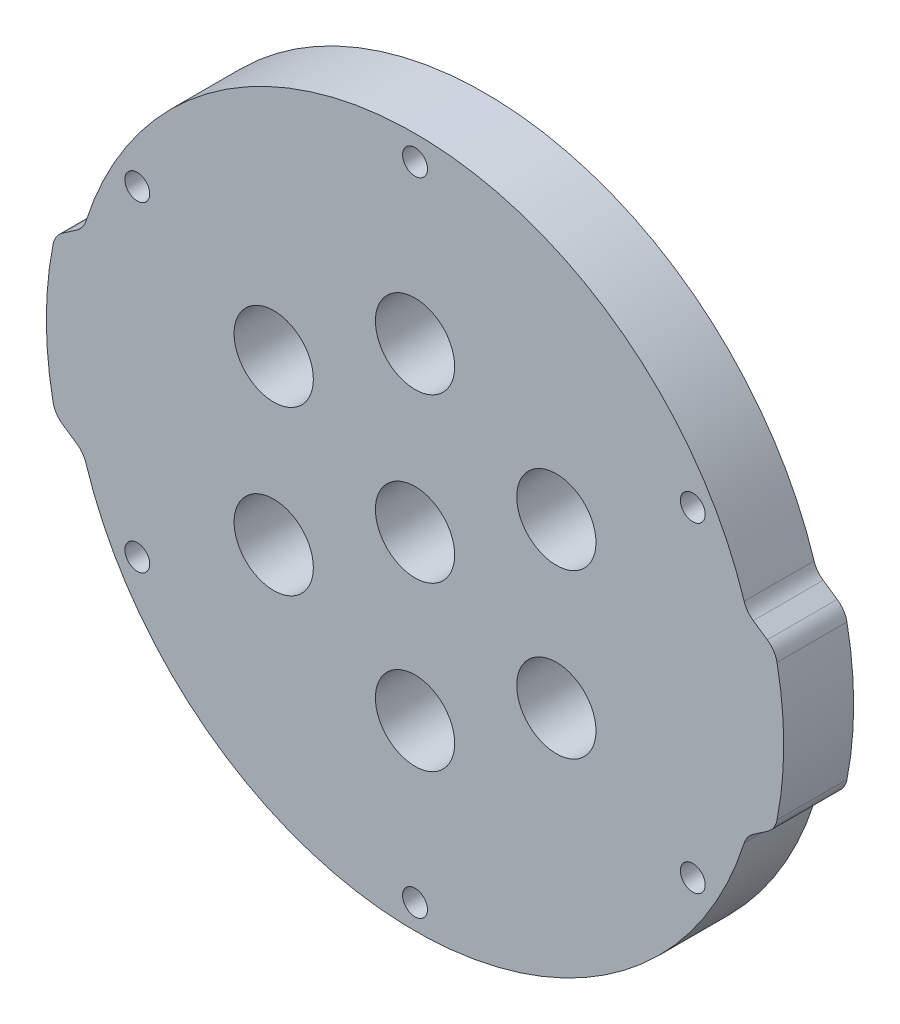
ISO-10303-21;
HEADER;
FILE_DESCRIPTION(('STEP AP214'),'2;1');
FILE_NAME('part.step','',(''),(''),'','','');
FILE_SCHEMA(('AUTOMOTIVE_DESIGN { 1 0 10303 214 1 1 1 1 }'));
ENDSEC;
DATA;
#1=APPLICATION_CONTEXT('core data for automotive mechanical design processes');
#2=APPLICATION_PROTOCOL_DEFINITION('international standard','automotive_design',2000,#1);
#3=PRODUCT_CONTEXT('',#1,'mechanical');
#4=PRODUCT('Part','Part','',(#3));
#5=PRODUCT_RELATED_PRODUCT_CATEGORY('part','',(#4));
#6=PRODUCT_DEFINITION_FORMATION('','',#4);
#7=PRODUCT_DEFINITION_CONTEXT('part definition',#1,'design');
#8=PRODUCT_DEFINITION('design','',#6,#7);
#9=PRODUCT_DEFINITION_SHAPE('','',#8);
#10=(LENGTH_UNIT() NAMED_UNIT(*) SI_UNIT(.MILLI.,.METRE.));
#11=(NAMED_UNIT(*) PLANE_ANGLE_UNIT() SI_UNIT($,.RADIAN.));
#12=(NAMED_UNIT(*) SI_UNIT($,.STERADIAN.) SOLID_ANGLE_UNIT());
#13=UNCERTAINTY_MEASURE_WITH_UNIT(LENGTH_MEASURE(1.E-05),#10,'distance_accuracy_value','');
#14=(GEOMETRIC_REPRESENTATION_CONTEXT(3) GLOBAL_UNCERTAINTY_ASSIGNED_CONTEXT((#13)) GLOBAL_UNIT_ASSIGNED_CONTEXT((#10,
#11,#12)) REPRESENTATION_CONTEXT('',''));
#15=CARTESIAN_POINT('',(0.,0.,0.));
#16=DIRECTION('',(0.,0.,1.));
#17=DIRECTION('',(1.,0.,0.));
#18=AXIS2_PLACEMENT_3D('',#15,#16,#17);
#19=CARTESIAN_POINT('',(2.45,0.,9.));
#20=DIRECTION('',(0.,0.,-1.));
#21=DIRECTION('',(-1.,0.,0.));
#22=AXIS2_PLACEMENT_3D('',#19,#20,#21);
#23=PLANE('',#22);
#24=CARTESIAN_POINT('',(-18.1865334794732,10.5,9.));
#25=DIRECTION('',(0.,0.,1.));
#26=DIRECTION('',(1.,0.,0.));
#27=AXIS2_PLACEMENT_3D('',#24,#25,#26);
#28=CIRCLE('',#27,5.1);
#29=CARTESIAN_POINT('',(-13.0865334794732,10.5,9.));
#30=VERTEX_POINT('',#29);
#31=EDGE_CURVE('E572',#30,#30,#28,.T.);
#32=ORIENTED_EDGE('',*,*,#31,.F.);
#33=EDGE_LOOP('',(#32));
#34=FACE_BOUND('',#33,.T.);
#35=CARTESIAN_POINT('',(-18.1865334794732,-10.5,9.));
#36=DIRECTION('',(0.,0.,1.));
#37=DIRECTION('',(1.,0.,0.));
#38=AXIS2_PLACEMENT_3D('',#35,#36,#37);
#39=CIRCLE('',#38,5.1);
#40=CARTESIAN_POINT('',(-13.0865334794732,-10.5,9.));
#41=VERTEX_POINT('',#40);
#42=EDGE_CURVE('E566',#41,#41,#39,.T.);
#43=ORIENTED_EDGE('',*,*,#42,.F.);
#44=EDGE_LOOP('',(#43));
#45=FACE_BOUND('',#44,.T.);
#46=CARTESIAN_POINT('',(0.,-21.,9.));
#47=DIRECTION('',(0.,0.,1.));
#48=DIRECTION('',(1.,0.,0.));
#49=AXIS2_PLACEMENT_3D('',#46,#47,#48);
#50=CIRCLE('',#49,5.1);
#51=CARTESIAN_POINT('',(5.1,-21.,9.));
#52=VERTEX_POINT('',#51);
#53=EDGE_CURVE('E560',#52,#52,#50,.T.);
#54=ORIENTED_EDGE('',*,*,#53,.F.);
#55=EDGE_LOOP('',(#54));
#56=FACE_BOUND('',#55,.T.);
#57=CARTESIAN_POINT('',(18.1865334794732,-10.5,9.));
#58=DIRECTION('',(0.,0.,1.));
#59=DIRECTION('',(1.,0.,0.));
#60=AXIS2_PLACEMENT_3D('',#57,#58,#59);
#61=CIRCLE('',#60,5.1);
#62=CARTESIAN_POINT('',(23.2865334794732,-10.5,9.));
#63=VERTEX_POINT('',#62);
#64=EDGE_CURVE('E554',#63,#63,#61,.T.);
#65=ORIENTED_EDGE('',*,*,#64,.F.);
#66=EDGE_LOOP('',(#65));
#67=FACE_BOUND('',#66,.T.);
#68=CARTESIAN_POINT('',(18.1865334794732,10.5,9.));
#69=DIRECTION('',(0.,0.,1.));
#70=DIRECTION('',(1.,0.,0.));
#71=AXIS2_PLACEMENT_3D('',#68,#69,#70);
#72=CIRCLE('',#71,5.09999999999999);
#73=CARTESIAN_POINT('',(23.2865334794732,10.5,9.));
#74=VERTEX_POINT('',#73);
#75=EDGE_CURVE('E548',#74,#74,#72,.T.);
#76=ORIENTED_EDGE('',*,*,#75,.F.);
#77=EDGE_LOOP('',(#76));
#78=FACE_BOUND('',#77,.T.);
#79=CARTESIAN_POINT('',(0.,0.,9.));
#80=DIRECTION('',(0.,0.,1.));
#81=DIRECTION('',(1.,0.,0.));
#82=AXIS2_PLACEMENT_3D('',#79,#80,#81);
#83=CIRCLE('',#82,5.1);
#84=CARTESIAN_POINT('',(5.1,0.,9.));
#85=VERTEX_POINT('',#84);
#86=EDGE_CURVE('E542',#85,#85,#83,.T.);
#87=ORIENTED_EDGE('',*,*,#86,.F.);
#88=EDGE_LOOP('',(#87));
#89=FACE_BOUND('',#88,.T.);
#90=CARTESIAN_POINT('',(0.,21.,9.));
#91=DIRECTION('',(0.,0.,1.));
#92=DIRECTION('',(1.,0.,0.));
#93=AXIS2_PLACEMENT_3D('',#90,#91,#92);
#94=CIRCLE('',#93,5.1);
#95=CARTESIAN_POINT('',(5.1,21.,9.));
#96=VERTEX_POINT('',#95);
#97=EDGE_CURVE('E536',#96,#96,#94,.T.);
#98=ORIENTED_EDGE('',*,*,#97,.F.);
#99=EDGE_LOOP('',(#98));
#100=FACE_BOUND('',#99,.T.);
#101=CARTESIAN_POINT('',(5.11138805749817E-12,-41.2750000000005,9.));
#102=DIRECTION('',(0.,0.,1.));
#103=DIRECTION('',(1.,0.,0.));
#104=AXIS2_PLACEMENT_3D('',#101,#102,#103);
#105=CIRCLE('',#104,1.6);
#106=CARTESIAN_POINT('',(1.60000000000511,-41.2750000000005,9.));
#107=VERTEX_POINT('',#106);
#108=EDGE_CURVE('E521',#107,#107,#105,.T.);
#109=ORIENTED_EDGE('',*,*,#108,.F.);
#110=EDGE_LOOP('',(#109));
#111=FACE_BOUND('',#110,.T.);
#112=CARTESIAN_POINT('',(35.7451985412042,20.6375000000021,9.));
#113=DIRECTION('',(0.,0.,1.));
#114=DIRECTION('',(1.,0.,0.));
#115=AXIS2_PLACEMENT_3D('',#112,#113,#114);
#116=CIRCLE('',#115,1.59999999999999);
#117=CARTESIAN_POINT('',(37.3451985412042,20.6375000000021,9.));
#118=VERTEX_POINT('',#117);
#119=EDGE_CURVE('E496',#118,#118,#116,.T.);
#120=ORIENTED_EDGE('',*,*,#119,.F.);
#121=EDGE_LOOP('',(#120));
#122=FACE_BOUND('',#121,.T.);
#123=CARTESIAN_POINT('',(0.,41.275,9.));
#124=DIRECTION('',(0.,0.,1.));
#125=DIRECTION('',(1.,0.,0.));
#126=AXIS2_PLACEMENT_3D('',#123,#124,#125);
#127=CIRCLE('',#126,1.6);
#128=CARTESIAN_POINT('',(1.6,41.275,9.));
#129=VERTEX_POINT('',#128);
#130=EDGE_CURVE('E174',#129,#129,#127,.T.);
#131=ORIENTED_EDGE('',*,*,#130,.F.);
#132=EDGE_LOOP('',(#131));
#133=FACE_BOUND('',#132,.T.);
#134=DIRECTION('',(0.826366164777737,0.563133165166583,0.));
#135=VECTOR('',#134,1.);
#136=CARTESIAN_POINT('',(46.3248219369606,-10.,9.));
#137=LINE('',#136,#135);
#138=CARTESIAN_POINT('',(43.5274449449631,-11.9062926663889,9.));
#139=VERTEX_POINT('',#138);
#140=CARTESIAN_POINT('',(45.3315955176947,-10.6768412854351,9.));
#141=VERTEX_POINT('',#140);
#142=EDGE_CURVE('E183',#139,#141,#137,.T.);
#143=ORIENTED_EDGE('',*,*,#142,.T.);
#144=CARTESIAN_POINT('',(43.642196022195,-8.19774279110192,9.));
#145=DIRECTION('',(0.,0.,-1.));
#146=DIRECTION('',(-1.,0.,0.));
#147=AXIS2_PLACEMENT_3D('',#144,#145,#146);
#148=CIRCLE('',#147,3.);
#149=CARTESIAN_POINT('',(46.5844957380661,-8.7832958476092,9.));
#150=VERTEX_POINT('',#149);
#151=EDGE_CURVE('E215',#141,#150,#148,.F.);
#152=ORIENTED_EDGE('',*,*,#151,.T.);
#153=CARTESIAN_POINT('',(2.45,0.,9.));
#154=DIRECTION('',(0.,0.,1.));
#155=DIRECTION('',(-1.,0.,0.));
#156=AXIS2_PLACEMENT_3D('',#153,#154,#155);
#157=CIRCLE('',#156,45.);
#158=CARTESIAN_POINT('',(46.5844957380661,8.7832958476092,9.));
#159=VERTEX_POINT('',#158);
#160=EDGE_CURVE('E166',#150,#159,#157,.T.);
#161=ORIENTED_EDGE('',*,*,#160,.T.);
#162=CARTESIAN_POINT('',(43.642196022195,8.19774279110192,9.));
#163=DIRECTION('',(0.,0.,-1.));
#164=DIRECTION('',(-1.,0.,0.));
#165=AXIS2_PLACEMENT_3D('',#162,#163,#164);
#166=CIRCLE('',#165,3.);
#167=CARTESIAN_POINT('',(45.3315955176947,10.6768412854351,9.));
#168=VERTEX_POINT('',#167);
#169=EDGE_CURVE('E213',#159,#168,#166,.F.);
#170=ORIENTED_EDGE('',*,*,#169,.T.);
#171=DIRECTION('',(-0.826366164777736,0.563133165166585,0.));
#172=VECTOR('',#171,1.);
#173=CARTESIAN_POINT('',(46.3248219369606,10.,9.));
#174=LINE('',#173,#172);
#175=CARTESIAN_POINT('',(43.5274449449631,11.9062926663889,9.));
#176=VERTEX_POINT('',#175);
#177=EDGE_CURVE('E283',#168,#176,#174,.T.);
#178=ORIENTED_EDGE('',*,*,#177,.T.);
#179=CARTESIAN_POINT('',(45.2168444404629,14.3853911607221,9.));
#180=DIRECTION('',(0.,0.,-1.));
#181=DIRECTION('',(-1.,0.,0.));
#182=AXIS2_PLACEMENT_3D('',#179,#180,#181);
#183=CIRCLE('',#182,3.);
#184=CARTESIAN_POINT('',(42.3580344653019,13.4758827627839,9.));
#185=VERTEX_POINT('',#184);
#186=EDGE_CURVE('E248',#176,#185,#183,.T.);
#187=ORIENTED_EDGE('',*,*,#186,.T.);
#188=CARTESIAN_POINT('',(0.,0.,9.));
#189=DIRECTION('',(0.,0.,1.));
#190=DIRECTION('',(1.,0.,0.));
#191=AXIS2_PLACEMENT_3D('',#188,#189,#190);
#192=CIRCLE('',#191,44.45);
#193=CARTESIAN_POINT('',(-42.3580344653019,13.4758827627839,9.));
#194=VERTEX_POINT('',#193);
#195=EDGE_CURVE('E274',#185,#194,#192,.T.);
#196=ORIENTED_EDGE('',*,*,#195,.T.);
#197=CARTESIAN_POINT('',(-45.2168444404629,14.3853911607221,9.));
#198=DIRECTION('',(0.,0.,-1.));
#199=DIRECTION('',(-1.,0.,0.));
#200=AXIS2_PLACEMENT_3D('',#197,#198,#199);
#201=CIRCLE('',#200,3.);
#202=CARTESIAN_POINT('',(-43.5274449449631,11.9062926663889,9.));
#203=VERTEX_POINT('',#202);
#204=EDGE_CURVE('E11',#194,#203,#201,.T.);
#205=ORIENTED_EDGE('',*,*,#204,.T.);
#206=DIRECTION('',(-0.826366164777736,-0.563133165166585,0.));
#207=VECTOR('',#206,1.);
#208=CARTESIAN_POINT('',(-46.3248219369606,10.,9.));
#209=LINE('',#208,#207);
#210=CARTESIAN_POINT('',(-45.3315955176947,10.6768412854351,9.));
#211=VERTEX_POINT('',#210);
#212=EDGE_CURVE('E272',#203,#211,#209,.T.);
#213=ORIENTED_EDGE('',*,*,#212,.T.);
#214=CARTESIAN_POINT('',(-43.642196022195,8.19774279110192,9.));
#215=DIRECTION('',(0.,0.,-1.));
#216=DIRECTION('',(-1.,0.,0.));
#217=AXIS2_PLACEMENT_3D('',#214,#215,#216);
#218=CIRCLE('',#217,3.);
#219=CARTESIAN_POINT('',(-46.5844957380661,8.7832958476092,9.));
#220=VERTEX_POINT('',#219);
#221=EDGE_CURVE('E209',#211,#220,#218,.F.);
#222=ORIENTED_EDGE('',*,*,#221,.T.);
#223=CARTESIAN_POINT('',(-2.45,0.,9.));
#224=DIRECTION('',(0.,0.,1.));
#225=DIRECTION('',(1.,0.,0.));
#226=AXIS2_PLACEMENT_3D('',#223,#224,#225);
#227=CIRCLE('',#226,45.);
#228=CARTESIAN_POINT('',(-46.5844957380661,-8.7832958476092,9.));
#229=VERTEX_POINT('',#228);
#230=EDGE_CURVE('E278',#220,#229,#227,.T.);
#231=ORIENTED_EDGE('',*,*,#230,.T.);
#232=CARTESIAN_POINT('',(-43.642196022195,-8.19774279110192,9.));
#233=DIRECTION('',(0.,0.,-1.));
#234=DIRECTION('',(-1.,0.,0.));
#235=AXIS2_PLACEMENT_3D('',#232,#233,#234);
#236=CIRCLE('',#235,3.);
#237=CARTESIAN_POINT('',(-45.3315955176947,-10.6768412854351,9.));
#238=VERTEX_POINT('',#237);
#239=EDGE_CURVE('E211',#229,#238,#236,.F.);
#240=ORIENTED_EDGE('',*,*,#239,.T.);
#241=DIRECTION('',(0.826366164777736,-0.563133165166585,0.));
#242=VECTOR('',#241,1.);
#243=CARTESIAN_POINT('',(-46.3248219369606,-10.,9.));
#244=LINE('',#243,#242);
#245=CARTESIAN_POINT('',(-43.5274449449631,-11.9062926663889,9.));
#246=VERTEX_POINT('',#245);
#247=EDGE_CURVE('E281',#238,#246,#244,.T.);
#248=ORIENTED_EDGE('',*,*,#247,.T.);
#249=CARTESIAN_POINT('',(-45.2168444404629,-14.3853911607221,9.));
#250=DIRECTION('',(0.,0.,-1.));
#251=DIRECTION('',(-1.,0.,0.));
#252=AXIS2_PLACEMENT_3D('',#249,#250,#251);
#253=CIRCLE('',#252,3.);
#254=CARTESIAN_POINT('',(-42.3580344653019,-13.475882762784,9.));
#255=VERTEX_POINT('',#254);
#256=EDGE_CURVE('E54',#246,#255,#253,.T.);
#257=ORIENTED_EDGE('',*,*,#256,.T.);
#258=CARTESIAN_POINT('',(0.,0.,9.));
#259=DIRECTION('',(0.,0.,1.));
#260=DIRECTION('',(1.,0.,0.));
#261=AXIS2_PLACEMENT_3D('',#258,#259,#260);
#262=CIRCLE('',#261,44.45);
#263=CARTESIAN_POINT('',(42.3580344653019,-13.4758827627839,9.));
#264=VERTEX_POINT('',#263);
#265=EDGE_CURVE('E287',#255,#264,#262,.T.);
#266=ORIENTED_EDGE('',*,*,#265,.T.);
#267=CARTESIAN_POINT('',(45.2168444404629,-14.3853911607221,9.));
#268=DIRECTION('',(0.,0.,-1.));
#269=DIRECTION('',(-1.,0.,0.));
#270=AXIS2_PLACEMENT_3D('',#267,#268,#269);
#271=CIRCLE('',#270,3.);
#272=EDGE_CURVE('E252',#264,#139,#271,.T.);
#273=ORIENTED_EDGE('',*,*,#272,.T.);
#274=EDGE_LOOP('',(#143,#152,#161,#170,#178,#187,#196,#205,#213,#222,#231,#240,#248,#257,#266,#273));
#275=FACE_BOUND('',#274,.T.);
#276=CARTESIAN_POINT('',(-35.7451985411991,-20.6375000000026,9.));
#277=DIRECTION('',(0.,0.,1.));
#278=DIRECTION('',(1.,0.,0.));
#279=AXIS2_PLACEMENT_3D('',#276,#277,#278);
#280=CIRCLE('',#279,1.6);
#281=CARTESIAN_POINT('',(-34.1451985411991,-20.6375000000026,9.));
#282=VERTEX_POINT('',#281);
#283=EDGE_CURVE('E492',#282,#282,#280,.T.);
#284=ORIENTED_EDGE('',*,*,#283,.F.);
#285=EDGE_LOOP('',(#284));
#286=FACE_BOUND('',#285,.T.);
#287=CARTESIAN_POINT('',(35.7451985412068,-20.6374999999982,9.));
#288=DIRECTION('',(0.,0.,1.));
#289=DIRECTION('',(1.,0.,0.));
#290=AXIS2_PLACEMENT_3D('',#287,#288,#289);
#291=CIRCLE('',#290,1.6);
#292=CARTESIAN_POINT('',(37.3451985412068,-20.6374999999982,9.));
#293=VERTEX_POINT('',#292);
#294=EDGE_CURVE('E516',#293,#293,#291,.T.);
#295=ORIENTED_EDGE('',*,*,#294,.F.);
#296=EDGE_LOOP('',(#295));
#297=FACE_BOUND('',#296,.T.);
#298=CARTESIAN_POINT('',(-35.7451985412017,20.6374999999976,9.));
#299=DIRECTION('',(0.,0.,1.));
#300=DIRECTION('',(1.,0.,0.));
#301=AXIS2_PLACEMENT_3D('',#298,#299,#300);
#302=CIRCLE('',#301,1.59999999999999);
#303=CARTESIAN_POINT('',(-34.1451985412017,20.6374999999976,9.));
#304=VERTEX_POINT('',#303);
#305=EDGE_CURVE('E527',#304,#304,#302,.T.);
#306=ORIENTED_EDGE('',*,*,#305,.F.);
#307=EDGE_LOOP('',(#306));
#308=FACE_BOUND('',#307,.T.);
#309=ADVANCED_FACE('F32',(#34,#45,#56,#67,#78,#89,#100,#111,#122,#133,#275,#286,#297,#308),#23,.F.);
#310=CARTESIAN_POINT('',(2.45,0.,0.));
#311=DIRECTION('',(0.,0.,-1.));
#312=DIRECTION('',(-1.,0.,0.));
#313=AXIS2_PLACEMENT_3D('',#310,#311,#312);
#314=PLANE('',#313);
#315=CARTESIAN_POINT('',(-18.1865334794732,10.5,0.));
#316=DIRECTION('',(0.,0.,1.));
#317=DIRECTION('',(1.,0.,0.));
#318=AXIS2_PLACEMENT_3D('',#315,#316,#317);
#319=CIRCLE('',#318,5.1);
#320=CARTESIAN_POINT('',(-13.0865334794732,10.5,0.));
#321=VERTEX_POINT('',#320);
#322=EDGE_CURVE('E569',#321,#321,#319,.T.);
#323=ORIENTED_EDGE('',*,*,#322,.T.);
#324=EDGE_LOOP('',(#323));
#325=FACE_BOUND('',#324,.T.);
#326=CARTESIAN_POINT('',(-18.1865334794732,-10.5,0.));
#327=DIRECTION('',(0.,0.,1.));
#328=DIRECTION('',(1.,0.,0.));
#329=AXIS2_PLACEMENT_3D('',#326,#327,#328);
#330=CIRCLE('',#329,5.1);
#331=CARTESIAN_POINT('',(-13.0865334794732,-10.5,0.));
#332=VERTEX_POINT('',#331);
#333=EDGE_CURVE('E563',#332,#332,#330,.T.);
#334=ORIENTED_EDGE('',*,*,#333,.T.);
#335=EDGE_LOOP('',(#334));
#336=FACE_BOUND('',#335,.T.);
#337=CARTESIAN_POINT('',(0.,-21.,0.));
#338=DIRECTION('',(0.,0.,1.));
#339=DIRECTION('',(1.,0.,0.));
#340=AXIS2_PLACEMENT_3D('',#337,#338,#339);
#341=CIRCLE('',#340,5.1);
#342=CARTESIAN_POINT('',(5.1,-21.,0.));
#343=VERTEX_POINT('',#342);
#344=EDGE_CURVE('E557',#343,#343,#341,.T.);
#345=ORIENTED_EDGE('',*,*,#344,.T.);
#346=EDGE_LOOP('',(#345));
#347=FACE_BOUND('',#346,.T.);
#348=CARTESIAN_POINT('',(18.1865334794732,-10.5,0.));
#349=DIRECTION('',(0.,0.,1.));
#350=DIRECTION('',(1.,0.,0.));
#351=AXIS2_PLACEMENT_3D('',#348,#349,#350);
#352=CIRCLE('',#351,5.1);
#353=CARTESIAN_POINT('',(23.2865334794732,-10.5,0.));
#354=VERTEX_POINT('',#353);
#355=EDGE_CURVE('E551',#354,#354,#352,.T.);
#356=ORIENTED_EDGE('',*,*,#355,.T.);
#357=EDGE_LOOP('',(#356));
#358=FACE_BOUND('',#357,.T.);
#359=CARTESIAN_POINT('',(18.1865334794732,10.5,0.));
#360=DIRECTION('',(0.,0.,1.));
#361=DIRECTION('',(1.,0.,0.));
#362=AXIS2_PLACEMENT_3D('',#359,#360,#361);
#363=CIRCLE('',#362,5.09999999999999);
#364=CARTESIAN_POINT('',(23.2865334794732,10.5,0.));
#365=VERTEX_POINT('',#364);
#366=EDGE_CURVE('E545',#365,#365,#363,.T.);
#367=ORIENTED_EDGE('',*,*,#366,.T.);
#368=EDGE_LOOP('',(#367));
#369=FACE_BOUND('',#368,.T.);
#370=CARTESIAN_POINT('',(0.,0.,0.));
#371=DIRECTION('',(0.,0.,1.));
#372=DIRECTION('',(1.,0.,0.));
#373=AXIS2_PLACEMENT_3D('',#370,#371,#372);
#374=CIRCLE('',#373,5.1);
#375=CARTESIAN_POINT('',(5.1,0.,0.));
#376=VERTEX_POINT('',#375);
#377=EDGE_CURVE('E539',#376,#376,#374,.T.);
#378=ORIENTED_EDGE('',*,*,#377,.T.);
#379=EDGE_LOOP('',(#378));
#380=FACE_BOUND('',#379,.T.);
#381=CARTESIAN_POINT('',(0.,21.,0.));
#382=DIRECTION('',(0.,0.,1.));
#383=DIRECTION('',(1.,0.,0.));
#384=AXIS2_PLACEMENT_3D('',#381,#382,#383);
#385=CIRCLE('',#384,5.1);
#386=CARTESIAN_POINT('',(5.1,21.,0.));
#387=VERTEX_POINT('',#386);
#388=EDGE_CURVE('E533',#387,#387,#385,.T.);
#389=ORIENTED_EDGE('',*,*,#388,.T.);
#390=EDGE_LOOP('',(#389));
#391=FACE_BOUND('',#390,.T.);
#392=CARTESIAN_POINT('',(5.11138805749817E-12,-41.2750000000005,0.));
#393=DIRECTION('',(0.,0.,1.));
#394=DIRECTION('',(1.,0.,0.));
#395=AXIS2_PLACEMENT_3D('',#392,#393,#394);
#396=CIRCLE('',#395,1.6);
#397=CARTESIAN_POINT('',(1.60000000000511,-41.2750000000005,0.));
#398=VERTEX_POINT('',#397);
#399=EDGE_CURVE('E524',#398,#398,#396,.T.);
#400=ORIENTED_EDGE('',*,*,#399,.T.);
#401=EDGE_LOOP('',(#400));
#402=FACE_BOUND('',#401,.T.);
#403=CARTESIAN_POINT('',(35.7451985412042,20.6375000000021,0.));
#404=DIRECTION('',(0.,0.,1.));
#405=DIRECTION('',(1.,0.,0.));
#406=AXIS2_PLACEMENT_3D('',#403,#404,#405);
#407=CIRCLE('',#406,1.59999999999999);
#408=CARTESIAN_POINT('',(37.3451985412042,20.6375000000021,0.));
#409=VERTEX_POINT('',#408);
#410=EDGE_CURVE('E500',#409,#409,#407,.T.);
#411=ORIENTED_EDGE('',*,*,#410,.T.);
#412=EDGE_LOOP('',(#411));
#413=FACE_BOUND('',#412,.T.);
#414=CARTESIAN_POINT('',(0.,41.275,0.));
#415=DIRECTION('',(0.,0.,1.));
#416=DIRECTION('',(1.,0.,0.));
#417=AXIS2_PLACEMENT_3D('',#414,#415,#416);
#418=CIRCLE('',#417,1.6);
#419=CARTESIAN_POINT('',(1.6,41.275,0.));
#420=VERTEX_POINT('',#419);
#421=EDGE_CURVE('E180',#420,#420,#418,.T.);
#422=ORIENTED_EDGE('',*,*,#421,.T.);
#423=EDGE_LOOP('',(#422));
#424=FACE_BOUND('',#423,.T.);
#425=CARTESIAN_POINT('',(2.45,0.,0.));
#426=DIRECTION('',(0.,0.,1.));
#427=DIRECTION('',(-1.,0.,0.));
#428=AXIS2_PLACEMENT_3D('',#425,#426,#427);
#429=CIRCLE('',#428,45.);
#430=CARTESIAN_POINT('',(46.5844957380661,-8.7832958476092,0.));
#431=VERTEX_POINT('',#430);
#432=CARTESIAN_POINT('',(46.5844957380661,8.7832958476092,0.));
#433=VERTEX_POINT('',#432);
#434=EDGE_CURVE('E163',#431,#433,#429,.T.);
#435=ORIENTED_EDGE('',*,*,#434,.F.);
#436=CARTESIAN_POINT('',(43.642196022195,-8.19774279110192,0.));
#437=DIRECTION('',(0.,0.,-1.));
#438=DIRECTION('',(-1.,0.,0.));
#439=AXIS2_PLACEMENT_3D('',#436,#437,#438);
#440=CIRCLE('',#439,3.);
#441=CARTESIAN_POINT('',(45.3315955176947,-10.6768412854351,0.));
#442=VERTEX_POINT('',#441);
#443=EDGE_CURVE('E146',#431,#442,#440,.T.);
#444=ORIENTED_EDGE('',*,*,#443,.T.);
#445=DIRECTION('',(0.826366164777737,0.563133165166583,0.));
#446=VECTOR('',#445,1.);
#447=CARTESIAN_POINT('',(46.3248219369606,-10.,0.));
#448=LINE('',#447,#446);
#449=CARTESIAN_POINT('',(43.5274449449631,-11.9062926663889,0.));
#450=VERTEX_POINT('',#449);
#451=EDGE_CURVE('E199',#450,#442,#448,.T.);
#452=ORIENTED_EDGE('',*,*,#451,.F.);
#453=CARTESIAN_POINT('',(45.2168444404629,-14.3853911607221,0.));
#454=DIRECTION('',(0.,0.,-1.));
#455=DIRECTION('',(-1.,0.,0.));
#456=AXIS2_PLACEMENT_3D('',#453,#454,#455);
#457=CIRCLE('',#456,3.);
#458=CARTESIAN_POINT('',(42.3580344653019,-13.4758827627839,0.));
#459=VERTEX_POINT('',#458);
#460=EDGE_CURVE('E250',#450,#459,#457,.F.);
#461=ORIENTED_EDGE('',*,*,#460,.T.);
#462=CARTESIAN_POINT('',(0.,0.,0.));
#463=DIRECTION('',(0.,0.,1.));
#464=DIRECTION('',(1.,0.,0.));
#465=AXIS2_PLACEMENT_3D('',#462,#463,#464);
#466=CIRCLE('',#465,44.45);
#467=CARTESIAN_POINT('',(-42.3580344653019,-13.475882762784,0.));
#468=VERTEX_POINT('',#467);
#469=EDGE_CURVE('E197',#468,#459,#466,.T.);
#470=ORIENTED_EDGE('',*,*,#469,.F.);
#471=CARTESIAN_POINT('',(-45.2168444404629,-14.3853911607221,0.));
#472=DIRECTION('',(0.,0.,-1.));
#473=DIRECTION('',(-1.,0.,0.));
#474=AXIS2_PLACEMENT_3D('',#471,#472,#473);
#475=CIRCLE('',#474,3.);
#476=CARTESIAN_POINT('',(-43.5274449449631,-11.9062926663889,0.));
#477=VERTEX_POINT('',#476);
#478=EDGE_CURVE('E254',#468,#477,#475,.F.);
#479=ORIENTED_EDGE('',*,*,#478,.T.);
#480=DIRECTION('',(0.826366164777736,-0.563133165166585,0.));
#481=VECTOR('',#480,1.);
#482=CARTESIAN_POINT('',(-46.3248219369606,-10.,0.));
#483=LINE('',#482,#481);
#484=CARTESIAN_POINT('',(-45.3315955176947,-10.6768412854351,0.));
#485=VERTEX_POINT('',#484);
#486=EDGE_CURVE('E194',#485,#477,#483,.T.);
#487=ORIENTED_EDGE('',*,*,#486,.F.);
#488=CARTESIAN_POINT('',(-43.642196022195,-8.19774279110192,0.));
#489=DIRECTION('',(0.,0.,-1.));
#490=DIRECTION('',(-1.,0.,0.));
#491=AXIS2_PLACEMENT_3D('',#488,#489,#490);
#492=CIRCLE('',#491,3.);
#493=CARTESIAN_POINT('',(-46.5844957380661,-8.7832958476092,0.));
#494=VERTEX_POINT('',#493);
#495=EDGE_CURVE('E203',#485,#494,#492,.T.);
#496=ORIENTED_EDGE('',*,*,#495,.T.);
#497=CARTESIAN_POINT('',(-2.45,0.,0.));
#498=DIRECTION('',(0.,0.,1.));
#499=DIRECTION('',(1.,0.,0.));
#500=AXIS2_PLACEMENT_3D('',#497,#498,#499);
#501=CIRCLE('',#500,45.);
#502=CARTESIAN_POINT('',(-46.5844957380661,8.7832958476092,0.));
#503=VERTEX_POINT('',#502);
#504=EDGE_CURVE('E191',#503,#494,#501,.T.);
#505=ORIENTED_EDGE('',*,*,#504,.F.);
#506=CARTESIAN_POINT('',(-43.642196022195,8.19774279110192,0.));
#507=DIRECTION('',(0.,0.,-1.));
#508=DIRECTION('',(-1.,0.,0.));
#509=AXIS2_PLACEMENT_3D('',#506,#507,#508);
#510=CIRCLE('',#509,3.);
#511=CARTESIAN_POINT('',(-45.3315955176947,10.6768412854351,0.));
#512=VERTEX_POINT('',#511);
#513=EDGE_CURVE('E167',#503,#512,#510,.T.);
#514=ORIENTED_EDGE('',*,*,#513,.T.);
#515=DIRECTION('',(-0.826366164777736,-0.563133165166585,0.));
#516=VECTOR('',#515,1.);
#517=CARTESIAN_POINT('',(-46.3248219369606,10.,0.));
#518=LINE('',#517,#516);
#519=CARTESIAN_POINT('',(-43.5274449449631,11.9062926663889,0.));
#520=VERTEX_POINT('',#519);
#521=EDGE_CURVE('E188',#520,#512,#518,.T.);
#522=ORIENTED_EDGE('',*,*,#521,.F.);
#523=CARTESIAN_POINT('',(-45.2168444404629,14.3853911607221,0.));
#524=DIRECTION('',(0.,0.,-1.));
#525=DIRECTION('',(-1.,0.,0.));
#526=AXIS2_PLACEMENT_3D('',#523,#524,#525);
#527=CIRCLE('',#526,3.);
#528=CARTESIAN_POINT('',(-42.3580344653019,13.4758827627839,0.));
#529=VERTEX_POINT('',#528);
#530=EDGE_CURVE('E40',#520,#529,#527,.F.);
#531=ORIENTED_EDGE('',*,*,#530,.T.);
#532=CARTESIAN_POINT('',(0.,0.,0.));
#533=DIRECTION('',(0.,0.,1.));
#534=DIRECTION('',(1.,0.,0.));
#535=AXIS2_PLACEMENT_3D('',#532,#533,#534);
#536=CIRCLE('',#535,44.45);
#537=CARTESIAN_POINT('',(42.3580344653019,13.4758827627839,0.));
#538=VERTEX_POINT('',#537);
#539=EDGE_CURVE('E177',#538,#529,#536,.T.);
#540=ORIENTED_EDGE('',*,*,#539,.F.);
#541=CARTESIAN_POINT('',(45.2168444404629,14.3853911607221,0.));
#542=DIRECTION('',(0.,0.,-1.));
#543=DIRECTION('',(-1.,0.,0.));
#544=AXIS2_PLACEMENT_3D('',#541,#542,#543);
#545=CIRCLE('',#544,3.);
#546=CARTESIAN_POINT('',(43.5274449449631,11.9062926663889,0.));
#547=VERTEX_POINT('',#546);
#548=EDGE_CURVE('E246',#538,#547,#545,.F.);
#549=ORIENTED_EDGE('',*,*,#548,.T.);
#550=DIRECTION('',(-0.826366164777736,0.563133165166585,0.));
#551=VECTOR('',#550,1.);
#552=CARTESIAN_POINT('',(46.3248219369606,10.,0.));
#553=LINE('',#552,#551);
#554=CARTESIAN_POINT('',(45.3315955176947,10.6768412854351,0.));
#555=VERTEX_POINT('',#554);
#556=EDGE_CURVE('E173',#555,#547,#553,.T.);
#557=ORIENTED_EDGE('',*,*,#556,.F.);
#558=CARTESIAN_POINT('',(43.642196022195,8.19774279110192,0.));
#559=DIRECTION('',(0.,0.,-1.));
#560=DIRECTION('',(-1.,0.,0.));
#561=AXIS2_PLACEMENT_3D('',#558,#559,#560);
#562=CIRCLE('',#561,3.);
#563=EDGE_CURVE('E157',#555,#433,#562,.T.);
#564=ORIENTED_EDGE('',*,*,#563,.T.);
#565=EDGE_LOOP('',(#435,#444,#452,#461,#470,#479,#487,#496,#505,#514,#522,#531,#540,#549,#557,#564));
#566=FACE_BOUND('',#565,.T.);
#567=CARTESIAN_POINT('',(-35.7451985411991,-20.6375000000026,0.));
#568=DIRECTION('',(0.,0.,1.));
#569=DIRECTION('',(1.,0.,0.));
#570=AXIS2_PLACEMENT_3D('',#567,#568,#569);
#571=CIRCLE('',#570,1.6);
#572=CARTESIAN_POINT('',(-34.1451985411991,-20.6375000000026,0.));
#573=VERTEX_POINT('',#572);
#574=EDGE_CURVE('E495',#573,#573,#571,.T.);
#575=ORIENTED_EDGE('',*,*,#574,.T.);
#576=EDGE_LOOP('',(#575));
#577=FACE_BOUND('',#576,.T.);
#578=CARTESIAN_POINT('',(35.7451985412068,-20.6374999999982,0.));
#579=DIRECTION('',(0.,0.,1.));
#580=DIRECTION('',(1.,0.,0.));
#581=AXIS2_PLACEMENT_3D('',#578,#579,#580);
#582=CIRCLE('',#581,1.6);
#583=CARTESIAN_POINT('',(37.3451985412068,-20.6374999999982,0.));
#584=VERTEX_POINT('',#583);
#585=EDGE_CURVE('E518',#584,#584,#582,.T.);
#586=ORIENTED_EDGE('',*,*,#585,.T.);
#587=EDGE_LOOP('',(#586));
#588=FACE_BOUND('',#587,.T.);
#589=CARTESIAN_POINT('',(-35.7451985412017,20.6374999999976,0.));
#590=DIRECTION('',(0.,0.,1.));
#591=DIRECTION('',(1.,0.,0.));
#592=AXIS2_PLACEMENT_3D('',#589,#590,#591);
#593=CIRCLE('',#592,1.59999999999999);
#594=CARTESIAN_POINT('',(-34.1451985412017,20.6374999999976,0.));
#595=VERTEX_POINT('',#594);
#596=EDGE_CURVE('E530',#595,#595,#593,.T.);
#597=ORIENTED_EDGE('',*,*,#596,.T.);
#598=EDGE_LOOP('',(#597));
#599=FACE_BOUND('',#598,.T.);
#600=ADVANCED_FACE('F170',(#325,#336,#347,#358,#369,#380,#391,#402,#413,#424,#566,#577,#588,
#599),#314,.T.);
#601=CARTESIAN_POINT('',(2.45,0.,9.));
#602=DIRECTION('',(0.,0.,-1.));
#603=DIRECTION('',(-1.,0.,0.));
#604=AXIS2_PLACEMENT_3D('',#601,#602,#603);
#605=CYLINDRICAL_SURFACE('',#604,45.);
#606=ORIENTED_EDGE('',*,*,#160,.F.);
#607=DIRECTION('',(0.,0.,-1.));
#608=VECTOR('',#607,1.);
#609=CARTESIAN_POINT('',(46.5844957380661,-8.7832958476092,9.));
#610=LINE('',#609,#608);
#611=EDGE_CURVE('E150',#150,#431,#610,.T.);
#612=ORIENTED_EDGE('',*,*,#611,.T.);
#613=ORIENTED_EDGE('',*,*,#434,.T.);
#614=DIRECTION('',(0.,0.,-1.));
#615=VECTOR('',#614,1.);
#616=CARTESIAN_POINT('',(46.5844957380661,8.7832958476092,9.));
#617=LINE('',#616,#615);
#618=EDGE_CURVE('E168',#433,#159,#617,.F.);
#619=ORIENTED_EDGE('',*,*,#618,.T.);
#620=EDGE_LOOP('',(#606,#612,#613,#619));
#621=FACE_BOUND('',#620,.T.);
#622=ADVANCED_FACE('F162',(#621),#605,.T.);
#623=CARTESIAN_POINT('',(46.3248219369606,10.,9.));
#624=DIRECTION('',(-0.563133165166585,-0.826366164777736,0.));
#625=DIRECTION('',(0.826366164777736,-0.563133165166585,0.));
#626=AXIS2_PLACEMENT_3D('',#623,#624,#625);
#627=PLANE('',#626);
#628=ORIENTED_EDGE('',*,*,#177,.F.);
#629=DIRECTION('',(0.,0.,-1.));
#630=VECTOR('',#629,1.);
#631=CARTESIAN_POINT('',(45.3315955176947,10.6768412854351,9.));
#632=LINE('',#631,#630);
#633=EDGE_CURVE('E219',#168,#555,#632,.T.);
#634=ORIENTED_EDGE('',*,*,#633,.T.);
#635=ORIENTED_EDGE('',*,*,#556,.T.);
#636=DIRECTION('',(0.,0.,1.));
#637=VECTOR('',#636,1.);
#638=CARTESIAN_POINT('',(43.5274449449631,11.9062926663889,9.));
#639=LINE('',#638,#637);
#640=EDGE_CURVE('E217',#547,#176,#639,.T.);
#641=ORIENTED_EDGE('',*,*,#640,.T.);
#642=EDGE_LOOP('',(#628,#634,#635,#641));
#643=FACE_BOUND('',#642,.T.);
#644=ADVANCED_FACE('F351',(#643),#627,.F.);
#645=CARTESIAN_POINT('',(0.,0.,9.));
#646=DIRECTION('',(0.,0.,-1.));
#647=DIRECTION('',(-1.,0.,0.));
#648=AXIS2_PLACEMENT_3D('',#645,#646,#647);
#649=CYLINDRICAL_SURFACE('',#648,44.45);
#650=ORIENTED_EDGE('',*,*,#195,.F.);
#651=DIRECTION('',(0.,0.,-1.));
#652=VECTOR('',#651,1.);
#653=CARTESIAN_POINT('',(42.3580344653019,13.475882762784,9.));
#654=LINE('',#653,#652);
#655=EDGE_CURVE('E224',#185,#538,#654,.T.);
#656=ORIENTED_EDGE('',*,*,#655,.T.);
#657=ORIENTED_EDGE('',*,*,#539,.T.);
#658=DIRECTION('',(0.,0.,-1.));
#659=VECTOR('',#658,1.);
#660=CARTESIAN_POINT('',(-42.3580344653019,13.475882762784,9.));
#661=LINE('',#660,#659);
#662=EDGE_CURVE('E222',#529,#194,#661,.F.);
#663=ORIENTED_EDGE('',*,*,#662,.T.);
#664=EDGE_LOOP('',(#650,#656,#657,#663));
#665=FACE_BOUND('',#664,.T.);
#666=ADVANCED_FACE('F263',(#665),#649,.T.);
#667=CARTESIAN_POINT('',(-46.3248219369606,10.,9.));
#668=DIRECTION('',(0.563133165166585,-0.826366164777736,0.));
#669=DIRECTION('',(0.826366164777736,0.563133165166585,0.));
#670=AXIS2_PLACEMENT_3D('',#667,#668,#669);
#671=PLANE('',#670);
#672=ORIENTED_EDGE('',*,*,#212,.F.);
#673=DIRECTION('',(0.,0.,1.));
#674=VECTOR('',#673,1.);
#675=CARTESIAN_POINT('',(-43.5274449449631,11.9062926663889,0.));
#676=LINE('',#675,#674);
#677=EDGE_CURVE('E243',#203,#520,#676,.F.);
#678=ORIENTED_EDGE('',*,*,#677,.T.);
#679=ORIENTED_EDGE('',*,*,#521,.T.);
#680=DIRECTION('',(0.,0.,-1.));
#681=VECTOR('',#680,1.);
#682=CARTESIAN_POINT('',(-45.3315955176947,10.6768412854351,9.));
#683=LINE('',#682,#681);
#684=EDGE_CURVE('E241',#512,#211,#683,.F.);
#685=ORIENTED_EDGE('',*,*,#684,.T.);
#686=EDGE_LOOP('',(#672,#678,#679,#685));
#687=FACE_BOUND('',#686,.T.);
#688=ADVANCED_FACE('F276',(#687),#671,.F.);
#689=CARTESIAN_POINT('',(-2.45,0.,9.));
#690=DIRECTION('',(0.,0.,-1.));
#691=DIRECTION('',(-1.,0.,0.));
#692=AXIS2_PLACEMENT_3D('',#689,#690,#691);
#693=CYLINDRICAL_SURFACE('',#692,45.);
#694=ORIENTED_EDGE('',*,*,#504,.T.);
#695=DIRECTION('',(0.,0.,-1.));
#696=VECTOR('',#695,1.);
#697=CARTESIAN_POINT('',(-46.5844957380661,-8.7832958476092,9.));
#698=LINE('',#697,#696);
#699=EDGE_CURVE('E239',#494,#229,#698,.F.);
#700=ORIENTED_EDGE('',*,*,#699,.T.);
#701=ORIENTED_EDGE('',*,*,#230,.F.);
#702=DIRECTION('',(0.,0.,-1.));
#703=VECTOR('',#702,1.);
#704=CARTESIAN_POINT('',(-46.5844957380661,8.7832958476092,9.));
#705=LINE('',#704,#703);
#706=EDGE_CURVE('E236',#220,#503,#705,.T.);
#707=ORIENTED_EDGE('',*,*,#706,.T.);
#708=EDGE_LOOP('',(#694,#700,#701,#707));
#709=FACE_BOUND('',#708,.T.);
#710=ADVANCED_FACE('F312',(#709),#693,.T.);
#711=CARTESIAN_POINT('',(-46.3248219369606,-10.,9.));
#712=DIRECTION('',(0.563133165166585,0.826366164777736,0.));
#713=DIRECTION('',(-0.826366164777736,0.563133165166585,0.));
#714=AXIS2_PLACEMENT_3D('',#711,#712,#713);
#715=PLANE('',#714);
#716=ORIENTED_EDGE('',*,*,#486,.T.);
#717=DIRECTION('',(0.,0.,1.));
#718=VECTOR('',#717,1.);
#719=CARTESIAN_POINT('',(-43.5274449449631,-11.9062926663889,9.));
#720=LINE('',#719,#718);
#721=EDGE_CURVE('E234',#477,#246,#720,.T.);
#722=ORIENTED_EDGE('',*,*,#721,.T.);
#723=ORIENTED_EDGE('',*,*,#247,.F.);
#724=DIRECTION('',(0.,0.,-1.));
#725=VECTOR('',#724,1.);
#726=CARTESIAN_POINT('',(-45.3315955176947,-10.6768412854351,9.));
#727=LINE('',#726,#725);
#728=EDGE_CURVE('E231',#238,#485,#727,.T.);
#729=ORIENTED_EDGE('',*,*,#728,.T.);
#730=EDGE_LOOP('',(#716,#722,#723,#729));
#731=FACE_BOUND('',#730,.T.);
#732=ADVANCED_FACE('F303',(#731),#715,.F.);
#733=CARTESIAN_POINT('',(0.,0.,9.));
#734=DIRECTION('',(0.,0.,-1.));
#735=DIRECTION('',(-1.,0.,0.));
#736=AXIS2_PLACEMENT_3D('',#733,#734,#735);
#737=CYLINDRICAL_SURFACE('',#736,44.45);
#738=ORIENTED_EDGE('',*,*,#469,.T.);
#739=DIRECTION('',(0.,0.,-1.));
#740=VECTOR('',#739,1.);
#741=CARTESIAN_POINT('',(42.3580344653019,-13.4758827627839,9.));
#742=LINE('',#741,#740);
#743=EDGE_CURVE('E47',#459,#264,#742,.F.);
#744=ORIENTED_EDGE('',*,*,#743,.T.);
#745=ORIENTED_EDGE('',*,*,#265,.F.);
#746=DIRECTION('',(0.,0.,-1.));
#747=VECTOR('',#746,1.);
#748=CARTESIAN_POINT('',(-42.3580344653019,-13.475882762784,9.));
#749=LINE('',#748,#747);
#750=EDGE_CURVE('E227',#255,#468,#749,.T.);
#751=ORIENTED_EDGE('',*,*,#750,.T.);
#752=EDGE_LOOP('',(#738,#744,#745,#751));
#753=FACE_BOUND('',#752,.T.);
#754=ADVANCED_FACE('F296',(#753),#737,.T.);
#755=CARTESIAN_POINT('',(46.3248219369606,-10.,9.));
#756=DIRECTION('',(-0.563133165166583,0.826366164777737,0.));
#757=DIRECTION('',(-0.826366164777737,-0.563133165166583,0.));
#758=AXIS2_PLACEMENT_3D('',#755,#756,#757);
#759=PLANE('',#758);
#760=ORIENTED_EDGE('',*,*,#451,.T.);
#761=DIRECTION('',(0.,0.,-1.));
#762=VECTOR('',#761,1.);
#763=CARTESIAN_POINT('',(45.3315955176947,-10.6768412854351,9.));
#764=LINE('',#763,#762);
#765=EDGE_CURVE('E151',#442,#141,#764,.F.);
#766=ORIENTED_EDGE('',*,*,#765,.T.);
#767=ORIENTED_EDGE('',*,*,#142,.F.);
#768=DIRECTION('',(0.,0.,1.));
#769=VECTOR('',#768,1.);
#770=CARTESIAN_POINT('',(43.5274449449631,-11.9062926663889,0.));
#771=LINE('',#770,#769);
#772=EDGE_CURVE('E156',#139,#450,#771,.F.);
#773=ORIENTED_EDGE('',*,*,#772,.T.);
#774=EDGE_LOOP('',(#760,#766,#767,#773));
#775=FACE_BOUND('',#774,.T.);
#776=ADVANCED_FACE('F292',(#775),#759,.F.);
#777=CARTESIAN_POINT('',(0.,41.275,9.));
#778=DIRECTION('',(0.,0.,-1.));
#779=DIRECTION('',(-1.,0.,0.));
#780=AXIS2_PLACEMENT_3D('',#777,#778,#779);
#781=CYLINDRICAL_SURFACE('',#780,1.6);
#782=ORIENTED_EDGE('',*,*,#130,.T.);
#783=EDGE_LOOP('',(#782));
#784=FACE_BOUND('',#783,.T.);
#785=ORIENTED_EDGE('',*,*,#421,.F.);
#786=EDGE_LOOP('',(#785));
#787=FACE_BOUND('',#786,.T.);
#788=ADVANCED_FACE('F336',(#784,#787),#781,.F.);
#789=CARTESIAN_POINT('',(-35.7451985411991,-20.6375000000026,9.));
#790=DIRECTION('',(0.,0.,-1.));
#791=DIRECTION('',(-1.,0.,0.));
#792=AXIS2_PLACEMENT_3D('',#789,#790,#791);
#793=CYLINDRICAL_SURFACE('',#792,1.6);
#794=ORIENTED_EDGE('',*,*,#283,.T.);
#795=EDGE_LOOP('',(#794));
#796=FACE_BOUND('',#795,.T.);
#797=ORIENTED_EDGE('',*,*,#574,.F.);
#798=EDGE_LOOP('',(#797));
#799=FACE_BOUND('',#798,.T.);
#800=ADVANCED_FACE('F481',(#796,#799),#793,.F.);
#801=CARTESIAN_POINT('',(35.7451985412042,20.6375000000021,9.));
#802=DIRECTION('',(0.,0.,-1.));
#803=DIRECTION('',(-1.,0.,0.));
#804=AXIS2_PLACEMENT_3D('',#801,#802,#803);
#805=CYLINDRICAL_SURFACE('',#804,1.59999999999999);
#806=ORIENTED_EDGE('',*,*,#119,.T.);
#807=EDGE_LOOP('',(#806));
#808=FACE_BOUND('',#807,.T.);
#809=ORIENTED_EDGE('',*,*,#410,.F.);
#810=EDGE_LOOP('',(#809));
#811=FACE_BOUND('',#810,.T.);
#812=ADVANCED_FACE('F478',(#808,#811),#805,.F.);
#813=CARTESIAN_POINT('',(35.7451985412068,-20.6374999999982,9.));
#814=DIRECTION('',(0.,0.,-1.));
#815=DIRECTION('',(-1.,0.,0.));
#816=AXIS2_PLACEMENT_3D('',#813,#814,#815);
#817=CYLINDRICAL_SURFACE('',#816,1.6);
#818=ORIENTED_EDGE('',*,*,#294,.T.);
#819=EDGE_LOOP('',(#818));
#820=FACE_BOUND('',#819,.T.);
#821=ORIENTED_EDGE('',*,*,#585,.F.);
#822=EDGE_LOOP('',(#821));
#823=FACE_BOUND('',#822,.T.);
#824=ADVANCED_FACE('F474',(#820,#823),#817,.F.);
#825=CARTESIAN_POINT('',(5.11138805749817E-12,-41.2750000000005,9.));
#826=DIRECTION('',(0.,0.,-1.));
#827=DIRECTION('',(-1.,0.,0.));
#828=AXIS2_PLACEMENT_3D('',#825,#826,#827);
#829=CYLINDRICAL_SURFACE('',#828,1.6);
#830=ORIENTED_EDGE('',*,*,#108,.T.);
#831=EDGE_LOOP('',(#830));
#832=FACE_BOUND('',#831,.T.);
#833=ORIENTED_EDGE('',*,*,#399,.F.);
#834=EDGE_LOOP('',(#833));
#835=FACE_BOUND('',#834,.T.);
#836=ADVANCED_FACE('F470',(#832,#835),#829,.F.);
#837=CARTESIAN_POINT('',(-35.7451985412017,20.6374999999976,9.));
#838=DIRECTION('',(0.,0.,-1.));
#839=DIRECTION('',(-1.,0.,0.));
#840=AXIS2_PLACEMENT_3D('',#837,#838,#839);
#841=CYLINDRICAL_SURFACE('',#840,1.59999999999999);
#842=ORIENTED_EDGE('',*,*,#305,.T.);
#843=EDGE_LOOP('',(#842));
#844=FACE_BOUND('',#843,.T.);
#845=ORIENTED_EDGE('',*,*,#596,.F.);
#846=EDGE_LOOP('',(#845));
#847=FACE_BOUND('',#846,.T.);
#848=ADVANCED_FACE('F360',(#844,#847),#841,.F.);
#849=CARTESIAN_POINT('',(43.642196022195,-8.19774279110192,9.));
#850=DIRECTION('',(0.,0.,-1.));
#851=DIRECTION('',(-1.,0.,0.));
#852=AXIS2_PLACEMENT_3D('',#849,#850,#851);
#853=CYLINDRICAL_SURFACE('',#852,3.);
#854=ORIENTED_EDGE('',*,*,#151,.F.);
#855=ORIENTED_EDGE('',*,*,#765,.F.);
#856=ORIENTED_EDGE('',*,*,#443,.F.);
#857=ORIENTED_EDGE('',*,*,#611,.F.);
#858=EDGE_LOOP('',(#854,#855,#856,#857));
#859=FACE_BOUND('',#858,.T.);
#860=ADVANCED_FACE('F149',(#859),#853,.T.);
#861=CARTESIAN_POINT('',(43.642196022195,8.19774279110192,9.));
#862=DIRECTION('',(0.,0.,-1.));
#863=DIRECTION('',(-1.,0.,0.));
#864=AXIS2_PLACEMENT_3D('',#861,#862,#863);
#865=CYLINDRICAL_SURFACE('',#864,3.);
#866=ORIENTED_EDGE('',*,*,#169,.F.);
#867=ORIENTED_EDGE('',*,*,#618,.F.);
#868=ORIENTED_EDGE('',*,*,#563,.F.);
#869=ORIENTED_EDGE('',*,*,#633,.F.);
#870=EDGE_LOOP('',(#866,#867,#868,#869));
#871=FACE_BOUND('',#870,.T.);
#872=ADVANCED_FACE('F359',(#871),#865,.T.);
#873=CARTESIAN_POINT('',(45.2168444404629,14.3853911607221,9.));
#874=DIRECTION('',(0.,0.,-1.));
#875=DIRECTION('',(-1.,0.,0.));
#876=AXIS2_PLACEMENT_3D('',#873,#874,#875);
#877=CYLINDRICAL_SURFACE('',#876,3.);
#878=ORIENTED_EDGE('',*,*,#186,.F.);
#879=ORIENTED_EDGE('',*,*,#640,.F.);
#880=ORIENTED_EDGE('',*,*,#548,.F.);
#881=ORIENTED_EDGE('',*,*,#655,.F.);
#882=EDGE_LOOP('',(#878,#879,#880,#881));
#883=FACE_BOUND('',#882,.T.);
#884=ADVANCED_FACE('F363',(#883),#877,.F.);
#885=CARTESIAN_POINT('',(45.2168444404629,-14.3853911607221,9.));
#886=DIRECTION('',(0.,0.,-1.));
#887=DIRECTION('',(-1.,0.,0.));
#888=AXIS2_PLACEMENT_3D('',#885,#886,#887);
#889=CYLINDRICAL_SURFACE('',#888,3.);
#890=ORIENTED_EDGE('',*,*,#272,.F.);
#891=ORIENTED_EDGE('',*,*,#743,.F.);
#892=ORIENTED_EDGE('',*,*,#460,.F.);
#893=ORIENTED_EDGE('',*,*,#772,.F.);
#894=EDGE_LOOP('',(#890,#891,#892,#893));
#895=FACE_BOUND('',#894,.T.);
#896=ADVANCED_FACE('F294',(#895),#889,.F.);
#897=CARTESIAN_POINT('',(-45.2168444404629,-14.3853911607221,9.));
#898=DIRECTION('',(0.,0.,-1.));
#899=DIRECTION('',(-1.,0.,0.));
#900=AXIS2_PLACEMENT_3D('',#897,#898,#899);
#901=CYLINDRICAL_SURFACE('',#900,3.);
#902=ORIENTED_EDGE('',*,*,#256,.F.);
#903=ORIENTED_EDGE('',*,*,#721,.F.);
#904=ORIENTED_EDGE('',*,*,#478,.F.);
#905=ORIENTED_EDGE('',*,*,#750,.F.);
#906=EDGE_LOOP('',(#902,#903,#904,#905));
#907=FACE_BOUND('',#906,.T.);
#908=ADVANCED_FACE('F299',(#907),#901,.F.);
#909=CARTESIAN_POINT('',(-43.642196022195,-8.19774279110192,9.));
#910=DIRECTION('',(0.,0.,-1.));
#911=DIRECTION('',(-1.,0.,0.));
#912=AXIS2_PLACEMENT_3D('',#909,#910,#911);
#913=CYLINDRICAL_SURFACE('',#912,3.);
#914=ORIENTED_EDGE('',*,*,#239,.F.);
#915=ORIENTED_EDGE('',*,*,#699,.F.);
#916=ORIENTED_EDGE('',*,*,#495,.F.);
#917=ORIENTED_EDGE('',*,*,#728,.F.);
#918=EDGE_LOOP('',(#914,#915,#916,#917));
#919=FACE_BOUND('',#918,.T.);
#920=ADVANCED_FACE('F308',(#919),#913,.T.);
#921=CARTESIAN_POINT('',(-45.2168444404629,14.3853911607221,9.));
#922=DIRECTION('',(0.,0.,-1.));
#923=DIRECTION('',(-1.,0.,0.));
#924=AXIS2_PLACEMENT_3D('',#921,#922,#923);
#925=CYLINDRICAL_SURFACE('',#924,3.);
#926=ORIENTED_EDGE('',*,*,#204,.F.);
#927=ORIENTED_EDGE('',*,*,#662,.F.);
#928=ORIENTED_EDGE('',*,*,#530,.F.);
#929=ORIENTED_EDGE('',*,*,#677,.F.);
#930=EDGE_LOOP('',(#926,#927,#928,#929));
#931=FACE_BOUND('',#930,.T.);
#932=ADVANCED_FACE('F267',(#931),#925,.F.);
#933=CARTESIAN_POINT('',(-43.642196022195,8.19774279110192,9.));
#934=DIRECTION('',(0.,0.,-1.));
#935=DIRECTION('',(-1.,0.,0.));
#936=AXIS2_PLACEMENT_3D('',#933,#934,#935);
#937=CYLINDRICAL_SURFACE('',#936,3.);
#938=ORIENTED_EDGE('',*,*,#221,.F.);
#939=ORIENTED_EDGE('',*,*,#684,.F.);
#940=ORIENTED_EDGE('',*,*,#513,.F.);
#941=ORIENTED_EDGE('',*,*,#706,.F.);
#942=EDGE_LOOP('',(#938,#939,#940,#941));
#943=FACE_BOUND('',#942,.T.);
#944=ADVANCED_FACE('F34',(#943),#937,.T.);
#945=CARTESIAN_POINT('',(0.,21.,0.));
#946=DIRECTION('',(0.,0.,1.));
#947=DIRECTION('',(1.,0.,0.));
#948=AXIS2_PLACEMENT_3D('',#945,#946,#947);
#949=CYLINDRICAL_SURFACE('',#948,5.1);
#950=ORIENTED_EDGE('',*,*,#388,.F.);
#951=EDGE_LOOP('',(#950));
#952=FACE_BOUND('',#951,.T.);
#953=ORIENTED_EDGE('',*,*,#97,.T.);
#954=EDGE_LOOP('',(#953));
#955=FACE_BOUND('',#954,.T.);
#956=ADVANCED_FACE('F317',(#952,#955),#949,.F.);
#957=CARTESIAN_POINT('',(0.,0.,0.));
#958=DIRECTION('',(0.,0.,1.));
#959=DIRECTION('',(1.,0.,0.));
#960=AXIS2_PLACEMENT_3D('',#957,#958,#959);
#961=CYLINDRICAL_SURFACE('',#960,5.1);
#962=ORIENTED_EDGE('',*,*,#377,.F.);
#963=EDGE_LOOP('',(#962));
#964=FACE_BOUND('',#963,.T.);
#965=ORIENTED_EDGE('',*,*,#86,.T.);
#966=EDGE_LOOP('',(#965));
#967=FACE_BOUND('',#966,.T.);
#968=ADVANCED_FACE('F322',(#964,#967),#961,.F.);
#969=CARTESIAN_POINT('',(18.1865334794732,10.5,0.));
#970=DIRECTION('',(0.,0.,1.));
#971=DIRECTION('',(1.,0.,0.));
#972=AXIS2_PLACEMENT_3D('',#969,#970,#971);
#973=CYLINDRICAL_SURFACE('',#972,5.09999999999999);
#974=ORIENTED_EDGE('',*,*,#366,.F.);
#975=EDGE_LOOP('',(#974));
#976=FACE_BOUND('',#975,.T.);
#977=ORIENTED_EDGE('',*,*,#75,.T.);
#978=EDGE_LOOP('',(#977));
#979=FACE_BOUND('',#978,.T.);
#980=ADVANCED_FACE('F411',(#976,#979),#973,.F.);
#981=CARTESIAN_POINT('',(18.1865334794732,-10.5,0.));
#982=DIRECTION('',(0.,0.,1.));
#983=DIRECTION('',(1.,0.,0.));
#984=AXIS2_PLACEMENT_3D('',#981,#982,#983);
#985=CYLINDRICAL_SURFACE('',#984,5.1);
#986=ORIENTED_EDGE('',*,*,#355,.F.);
#987=EDGE_LOOP('',(#986));
#988=FACE_BOUND('',#987,.T.);
#989=ORIENTED_EDGE('',*,*,#64,.T.);
#990=EDGE_LOOP('',(#989));
#991=FACE_BOUND('',#990,.T.);
#992=ADVANCED_FACE('F421',(#988,#991),#985,.F.);
#993=CARTESIAN_POINT('',(0.,-21.,0.));
#994=DIRECTION('',(0.,0.,1.));
#995=DIRECTION('',(1.,0.,0.));
#996=AXIS2_PLACEMENT_3D('',#993,#994,#995);
#997=CYLINDRICAL_SURFACE('',#996,5.1);
#998=ORIENTED_EDGE('',*,*,#344,.F.);
#999=EDGE_LOOP('',(#998));
#1000=FACE_BOUND('',#999,.T.);
#1001=ORIENTED_EDGE('',*,*,#53,.T.);
#1002=EDGE_LOOP('',(#1001));
#1003=FACE_BOUND('',#1002,.T.);
#1004=ADVANCED_FACE('F431',(#1000,#1003),#997,.F.);
#1005=CARTESIAN_POINT('',(-18.1865334794732,-10.5,0.));
#1006=DIRECTION('',(0.,0.,1.));
#1007=DIRECTION('',(1.,0.,0.));
#1008=AXIS2_PLACEMENT_3D('',#1005,#1006,#1007);
#1009=CYLINDRICAL_SURFACE('',#1008,5.1);
#1010=ORIENTED_EDGE('',*,*,#333,.F.);
#1011=EDGE_LOOP('',(#1010));
#1012=FACE_BOUND('',#1011,.T.);
#1013=ORIENTED_EDGE('',*,*,#42,.T.);
#1014=EDGE_LOOP('',(#1013));
#1015=FACE_BOUND('',#1014,.T.);
#1016=ADVANCED_FACE('F441',(#1012,#1015),#1009,.F.);
#1017=CARTESIAN_POINT('',(-18.1865334794732,10.5,0.));
#1018=DIRECTION('',(0.,0.,1.));
#1019=DIRECTION('',(1.,0.,0.));
#1020=AXIS2_PLACEMENT_3D('',#1017,#1018,#1019);
#1021=CYLINDRICAL_SURFACE('',#1020,5.1);
#1022=ORIENTED_EDGE('',*,*,#322,.F.);
#1023=EDGE_LOOP('',(#1022));
#1024=FACE_BOUND('',#1023,.T.);
#1025=ORIENTED_EDGE('',*,*,#31,.T.);
#1026=EDGE_LOOP('',(#1025));
#1027=FACE_BOUND('',#1026,.T.);
#1028=ADVANCED_FACE('F451',(#1024,#1027),#1021,.F.);
#1029=CLOSED_SHELL('',(#309,#600,#622,#644,#666,#688,#710,#732,#754,#776,#788,#800,#812,#824,
#836,#848,#860,#872,#884,#896,#908,#920,#932,#944,#956,#968,#980,#992,#1004,#1016,#1028));
#1030=MANIFOLD_SOLID_BREP('B2',#1029);
#1031=ADVANCED_BREP_SHAPE_REPRESENTATION('',(#18,#1030),#14);
#1032=SHAPE_DEFINITION_REPRESENTATION(#9,#1031);
ENDSEC;
END-ISO-10303-21;
